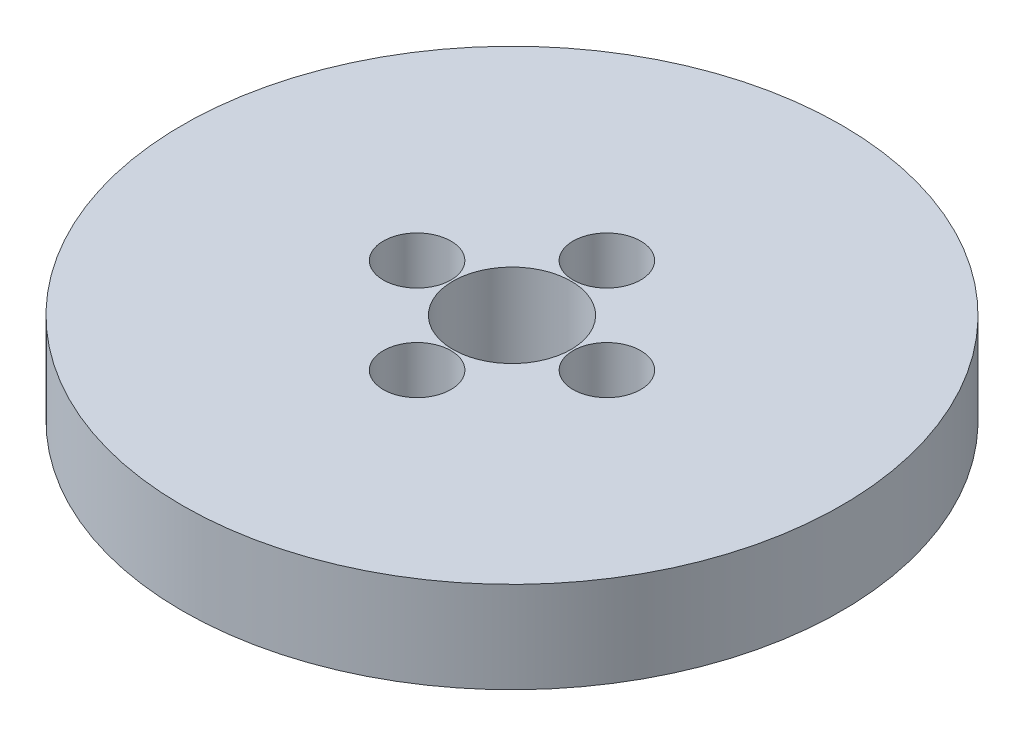
ISO-10303-21;
HEADER;
FILE_DESCRIPTION(('STEP AP214'),'2;1');
FILE_NAME('part.step','',(''),(''),'','','');
FILE_SCHEMA(('AUTOMOTIVE_DESIGN { 1 0 10303 214 1 1 1 1 }'));
ENDSEC;
DATA;
#1=APPLICATION_CONTEXT('core data for automotive mechanical design processes');
#2=APPLICATION_PROTOCOL_DEFINITION('international standard','automotive_design',2000,#1);
#3=PRODUCT_CONTEXT('',#1,'mechanical');
#4=PRODUCT('Part','Part','',(#3));
#5=PRODUCT_RELATED_PRODUCT_CATEGORY('part','',(#4));
#6=PRODUCT_DEFINITION_FORMATION('','',#4);
#7=PRODUCT_DEFINITION_CONTEXT('part definition',#1,'design');
#8=PRODUCT_DEFINITION('design','',#6,#7);
#9=PRODUCT_DEFINITION_SHAPE('','',#8);
#10=(LENGTH_UNIT() NAMED_UNIT(*) SI_UNIT(.MILLI.,.METRE.));
#11=(NAMED_UNIT(*) PLANE_ANGLE_UNIT() SI_UNIT($,.RADIAN.));
#12=(NAMED_UNIT(*) SI_UNIT($,.STERADIAN.) SOLID_ANGLE_UNIT());
#13=UNCERTAINTY_MEASURE_WITH_UNIT(LENGTH_MEASURE(1.E-05),#10,'distance_accuracy_value','');
#14=(GEOMETRIC_REPRESENTATION_CONTEXT(3) GLOBAL_UNCERTAINTY_ASSIGNED_CONTEXT((#13)) GLOBAL_UNIT_ASSIGNED_CONTEXT((#10,
#11,#12)) REPRESENTATION_CONTEXT('',''));
#15=CARTESIAN_POINT('',(0.,0.,0.));
#16=DIRECTION('',(0.,0.,1.));
#17=DIRECTION('',(1.,0.,0.));
#18=AXIS2_PLACEMENT_3D('',#15,#16,#17);
#19=CARTESIAN_POINT('',(0.,27.,0.));
#20=DIRECTION('',(0.,-1.,0.));
#21=DIRECTION('',(0.,0.,-1.));
#22=AXIS2_PLACEMENT_3D('',#19,#20,#21);
#23=CYLINDRICAL_SURFACE('',#22,97.5);
#24=CARTESIAN_POINT('',(0.,27.,0.));
#25=DIRECTION('',(0.,1.,0.));
#26=DIRECTION('',(0.,0.,1.));
#27=AXIS2_PLACEMENT_3D('',#24,#25,#26);
#28=CIRCLE('',#27,97.5);
#29=CARTESIAN_POINT('',(0.,27.,97.5));
#30=VERTEX_POINT('',#29);
#31=EDGE_CURVE('E10',#30,#30,#28,.T.);
#32=ORIENTED_EDGE('',*,*,#31,.F.);
#33=EDGE_LOOP('',(#32));
#34=FACE_BOUND('',#33,.T.);
#35=CARTESIAN_POINT('',(0.,0.,0.));
#36=DIRECTION('',(0.,1.,0.));
#37=DIRECTION('',(0.,0.,1.));
#38=AXIS2_PLACEMENT_3D('',#35,#36,#37);
#39=CIRCLE('',#38,97.5);
#40=CARTESIAN_POINT('',(0.,0.,97.5));
#41=VERTEX_POINT('',#40);
#42=EDGE_CURVE('E37',#41,#41,#39,.T.);
#43=ORIENTED_EDGE('',*,*,#42,.T.);
#44=EDGE_LOOP('',(#43));
#45=FACE_BOUND('',#44,.T.);
#46=ADVANCED_FACE('F40',(#34,#45),#23,.T.);
#47=CARTESIAN_POINT('',(0.,27.,0.));
#48=DIRECTION('',(0.,1.,0.));
#49=DIRECTION('',(0.,0.,1.));
#50=AXIS2_PLACEMENT_3D('',#47,#48,#49);
#51=PLANE('',#50);
#52=CARTESIAN_POINT('',(0.,27.,28.0744615200741));
#53=DIRECTION('',(0.,1.,0.));
#54=DIRECTION('',(1.,0.,0.));
#55=AXIS2_PLACEMENT_3D('',#52,#53,#54);
#56=CIRCLE('',#55,10.);
#57=CARTESIAN_POINT('',(10.0000000000001,27.,28.074461520074));
#58=VERTEX_POINT('',#57);
#59=EDGE_CURVE('E71',#58,#58,#56,.T.);
#60=ORIENTED_EDGE('',*,*,#59,.F.);
#61=EDGE_LOOP('',(#60));
#62=FACE_BOUND('',#61,.T.);
#63=CARTESIAN_POINT('',(28.0744615200741,27.,0.));
#64=DIRECTION('',(0.,1.,0.));
#65=DIRECTION('',(0.,0.,-1.));
#66=AXIS2_PLACEMENT_3D('',#63,#64,#65);
#67=CIRCLE('',#66,10.);
#68=CARTESIAN_POINT('',(28.0744615200741,27.,-10.));
#69=VERTEX_POINT('',#68);
#70=EDGE_CURVE('E70',#69,#69,#67,.T.);
#71=ORIENTED_EDGE('',*,*,#70,.F.);
#72=EDGE_LOOP('',(#71));
#73=FACE_BOUND('',#72,.T.);
#74=CARTESIAN_POINT('',(-2.94064375486225E-13,27.,-28.0744615200741));
#75=DIRECTION('',(0.,1.,0.));
#76=DIRECTION('',(-1.,0.,0.));
#77=AXIS2_PLACEMENT_3D('',#74,#75,#76);
#78=CIRCLE('',#77,10.);
#79=CARTESIAN_POINT('',(-10.0000000000003,27.,-28.0744615200739));
#80=VERTEX_POINT('',#79);
#81=EDGE_CURVE('E61',#80,#80,#78,.T.);
#82=ORIENTED_EDGE('',*,*,#81,.F.);
#83=EDGE_LOOP('',(#82));
#84=FACE_BOUND('',#83,.T.);
#85=CARTESIAN_POINT('',(-28.0744615200741,27.,0.));
#86=DIRECTION('',(0.,1.,0.));
#87=DIRECTION('',(0.,0.,1.));
#88=AXIS2_PLACEMENT_3D('',#85,#86,#87);
#89=CIRCLE('',#88,10.);
#90=CARTESIAN_POINT('',(-28.0744615200741,27.,10.));
#91=VERTEX_POINT('',#90);
#92=EDGE_CURVE('E54',#91,#91,#89,.T.);
#93=ORIENTED_EDGE('',*,*,#92,.F.);
#94=EDGE_LOOP('',(#93));
#95=FACE_BOUND('',#94,.T.);
#96=CARTESIAN_POINT('',(0.,27.,0.));
#97=DIRECTION('',(0.,1.,0.));
#98=DIRECTION('',(0.,0.,1.));
#99=AXIS2_PLACEMENT_3D('',#96,#97,#98);
#100=CIRCLE('',#99,17.5);
#101=CARTESIAN_POINT('',(0.,27.,17.5));
#102=VERTEX_POINT('',#101);
#103=EDGE_CURVE('E50',#102,#102,#100,.T.);
#104=ORIENTED_EDGE('',*,*,#103,.F.);
#105=EDGE_LOOP('',(#104));
#106=FACE_BOUND('',#105,.T.);
#107=ORIENTED_EDGE('',*,*,#31,.T.);
#108=EDGE_LOOP('',(#107));
#109=FACE_BOUND('',#108,.T.);
#110=ADVANCED_FACE('F86',(#62,#73,#84,#95,#106,#109),#51,.T.);
#111=CARTESIAN_POINT('',(0.,0.,0.));
#112=DIRECTION('',(0.,1.,0.));
#113=DIRECTION('',(0.,0.,1.));
#114=AXIS2_PLACEMENT_3D('',#111,#112,#113);
#115=PLANE('',#114);
#116=CARTESIAN_POINT('',(0.,0.,0.));
#117=DIRECTION('',(0.,1.,0.));
#118=DIRECTION('',(0.,0.,1.));
#119=AXIS2_PLACEMENT_3D('',#116,#117,#118);
#120=CIRCLE('',#119,17.5);
#121=CARTESIAN_POINT('',(0.,0.,17.5));
#122=VERTEX_POINT('',#121);
#123=EDGE_CURVE('E47',#122,#122,#120,.T.);
#124=ORIENTED_EDGE('',*,*,#123,.T.);
#125=EDGE_LOOP('',(#124));
#126=FACE_BOUND('',#125,.T.);
#127=ORIENTED_EDGE('',*,*,#42,.F.);
#128=EDGE_LOOP('',(#127));
#129=FACE_BOUND('',#128,.T.);
#130=ADVANCED_FACE('F93',(#126,#129),#115,.F.);
#131=CARTESIAN_POINT('',(0.,27.,0.));
#132=DIRECTION('',(0.,-1.,0.));
#133=DIRECTION('',(0.,0.,-1.));
#134=AXIS2_PLACEMENT_3D('',#131,#132,#133);
#135=CYLINDRICAL_SURFACE('',#134,17.5);
#136=ORIENTED_EDGE('',*,*,#103,.T.);
#137=EDGE_LOOP('',(#136));
#138=FACE_BOUND('',#137,.T.);
#139=ORIENTED_EDGE('',*,*,#123,.F.);
#140=EDGE_LOOP('',(#139));
#141=FACE_BOUND('',#140,.T.);
#142=ADVANCED_FACE('F101',(#138,#141),#135,.F.);
#143=CARTESIAN_POINT('',(-28.0744615200741,8.36286851276704,0.));
#144=DIRECTION('',(0.,1.,0.));
#145=DIRECTION('',(0.,0.,1.));
#146=AXIS2_PLACEMENT_3D('',#143,#144,#145);
#147=CYLINDRICAL_SURFACE('',#146,10.);
#148=CARTESIAN_POINT('',(-28.0744615200741,8.36286851276704,0.));
#149=DIRECTION('',(0.,1.,0.));
#150=DIRECTION('',(0.,0.,1.));
#151=AXIS2_PLACEMENT_3D('',#148,#149,#150);
#152=CIRCLE('',#151,10.);
#153=CARTESIAN_POINT('',(-28.0744615200741,8.36286851276704,10.));
#154=VERTEX_POINT('',#153);
#155=EDGE_CURVE('E55',#154,#154,#152,.T.);
#156=ORIENTED_EDGE('',*,*,#155,.F.);
#157=EDGE_LOOP('',(#156));
#158=FACE_BOUND('',#157,.T.);
#159=ORIENTED_EDGE('',*,*,#92,.T.);
#160=EDGE_LOOP('',(#159));
#161=FACE_BOUND('',#160,.T.);
#162=ADVANCED_FACE('F102',(#158,#161),#147,.F.);
#163=CARTESIAN_POINT('',(-28.0744615200741,8.36286851276704,0.));
#164=DIRECTION('',(0.,1.,0.));
#165=DIRECTION('',(0.,0.,1.));
#166=AXIS2_PLACEMENT_3D('',#163,#164,#165);
#167=PLANE('',#166);
#168=ORIENTED_EDGE('',*,*,#155,.T.);
#169=EDGE_LOOP('',(#168));
#170=FACE_BOUND('',#169,.T.);
#171=ADVANCED_FACE('F133',(#170),#167,.T.);
#172=CARTESIAN_POINT('',(-2.94064375486225E-13,8.36286851276704,-28.0744615200741));
#173=DIRECTION('',(0.,1.,0.));
#174=DIRECTION('',(0.,0.,1.));
#175=AXIS2_PLACEMENT_3D('',#172,#173,#174);
#176=CYLINDRICAL_SURFACE('',#175,10.);
#177=CARTESIAN_POINT('',(-2.94064375486225E-13,8.36286851276704,-28.0744615200741));
#178=DIRECTION('',(0.,1.,0.));
#179=DIRECTION('',(-1.,0.,0.));
#180=AXIS2_PLACEMENT_3D('',#177,#178,#179);
#181=CIRCLE('',#180,10.);
#182=CARTESIAN_POINT('',(-10.0000000000003,8.36286851276704,-28.0744615200739));
#183=VERTEX_POINT('',#182);
#184=EDGE_CURVE('E63',#183,#183,#181,.T.);
#185=ORIENTED_EDGE('',*,*,#184,.F.);
#186=EDGE_LOOP('',(#185));
#187=FACE_BOUND('',#186,.T.);
#188=ORIENTED_EDGE('',*,*,#81,.T.);
#189=EDGE_LOOP('',(#188));
#190=FACE_BOUND('',#189,.T.);
#191=ADVANCED_FACE('F142',(#187,#190),#176,.F.);
#192=CARTESIAN_POINT('',(-2.94064375486225E-13,8.36286851276704,-28.0744615200741));
#193=DIRECTION('',(0.,1.,0.));
#194=DIRECTION('',(-1.,0.,0.));
#195=AXIS2_PLACEMENT_3D('',#192,#193,#194);
#196=PLANE('',#195);
#197=ORIENTED_EDGE('',*,*,#184,.T.);
#198=EDGE_LOOP('',(#197));
#199=FACE_BOUND('',#198,.T.);
#200=ADVANCED_FACE('F156',(#199),#196,.T.);
#201=CARTESIAN_POINT('',(28.0744615200741,8.36286851276704,0.));
#202=DIRECTION('',(0.,1.,0.));
#203=DIRECTION('',(0.,0.,1.));
#204=AXIS2_PLACEMENT_3D('',#201,#202,#203);
#205=CYLINDRICAL_SURFACE('',#204,10.);
#206=CARTESIAN_POINT('',(28.0744615200741,8.36286851276704,0.));
#207=DIRECTION('',(0.,1.,0.));
#208=DIRECTION('',(0.,0.,-1.));
#209=AXIS2_PLACEMENT_3D('',#206,#207,#208);
#210=CIRCLE('',#209,10.);
#211=CARTESIAN_POINT('',(28.0744615200741,8.36286851276704,-10.));
#212=VERTEX_POINT('',#211);
#213=EDGE_CURVE('E69',#212,#212,#210,.T.);
#214=ORIENTED_EDGE('',*,*,#213,.F.);
#215=EDGE_LOOP('',(#214));
#216=FACE_BOUND('',#215,.T.);
#217=ORIENTED_EDGE('',*,*,#70,.T.);
#218=EDGE_LOOP('',(#217));
#219=FACE_BOUND('',#218,.T.);
#220=ADVANCED_FACE('F164',(#216,#219),#205,.F.);
#221=CARTESIAN_POINT('',(28.0744615200741,8.36286851276704,0.));
#222=DIRECTION('',(0.,1.,0.));
#223=DIRECTION('',(0.,0.,-1.));
#224=AXIS2_PLACEMENT_3D('',#221,#222,#223);
#225=PLANE('',#224);
#226=ORIENTED_EDGE('',*,*,#213,.T.);
#227=EDGE_LOOP('',(#226));
#228=FACE_BOUND('',#227,.T.);
#229=ADVANCED_FACE('F83',(#228),#225,.T.);
#230=CARTESIAN_POINT('',(0.,8.36286851276704,28.0744615200741));
#231=DIRECTION('',(0.,1.,0.));
#232=DIRECTION('',(0.,0.,1.));
#233=AXIS2_PLACEMENT_3D('',#230,#231,#232);
#234=CYLINDRICAL_SURFACE('',#233,10.);
#235=CARTESIAN_POINT('',(0.,8.36286851276704,28.0744615200741));
#236=DIRECTION('',(0.,1.,0.));
#237=DIRECTION('',(1.,0.,0.));
#238=AXIS2_PLACEMENT_3D('',#235,#236,#237);
#239=CIRCLE('',#238,10.);
#240=CARTESIAN_POINT('',(10.0000000000001,8.36286851276704,28.074461520074));
#241=VERTEX_POINT('',#240);
#242=EDGE_CURVE('E59',#241,#241,#239,.T.);
#243=ORIENTED_EDGE('',*,*,#242,.F.);
#244=EDGE_LOOP('',(#243));
#245=FACE_BOUND('',#244,.T.);
#246=ORIENTED_EDGE('',*,*,#59,.T.);
#247=EDGE_LOOP('',(#246));
#248=FACE_BOUND('',#247,.T.);
#249=ADVANCED_FACE('F81',(#245,#248),#234,.F.);
#250=CARTESIAN_POINT('',(0.,8.36286851276704,28.0744615200741));
#251=DIRECTION('',(0.,1.,0.));
#252=DIRECTION('',(1.,0.,0.));
#253=AXIS2_PLACEMENT_3D('',#250,#251,#252);
#254=PLANE('',#253);
#255=ORIENTED_EDGE('',*,*,#242,.T.);
#256=EDGE_LOOP('',(#255));
#257=FACE_BOUND('',#256,.T.);
#258=ADVANCED_FACE('F78',(#257),#254,.T.);
#259=CLOSED_SHELL('',(#46,#110,#130,#142,#162,#171,#191,#200,#220,#229,#249,#258));
#260=MANIFOLD_SOLID_BREP('B2',#259);
#261=ADVANCED_BREP_SHAPE_REPRESENTATION('',(#18,#260),#14);
#262=SHAPE_DEFINITION_REPRESENTATION(#9,#261);
ENDSEC;
END-ISO-10303-21;
